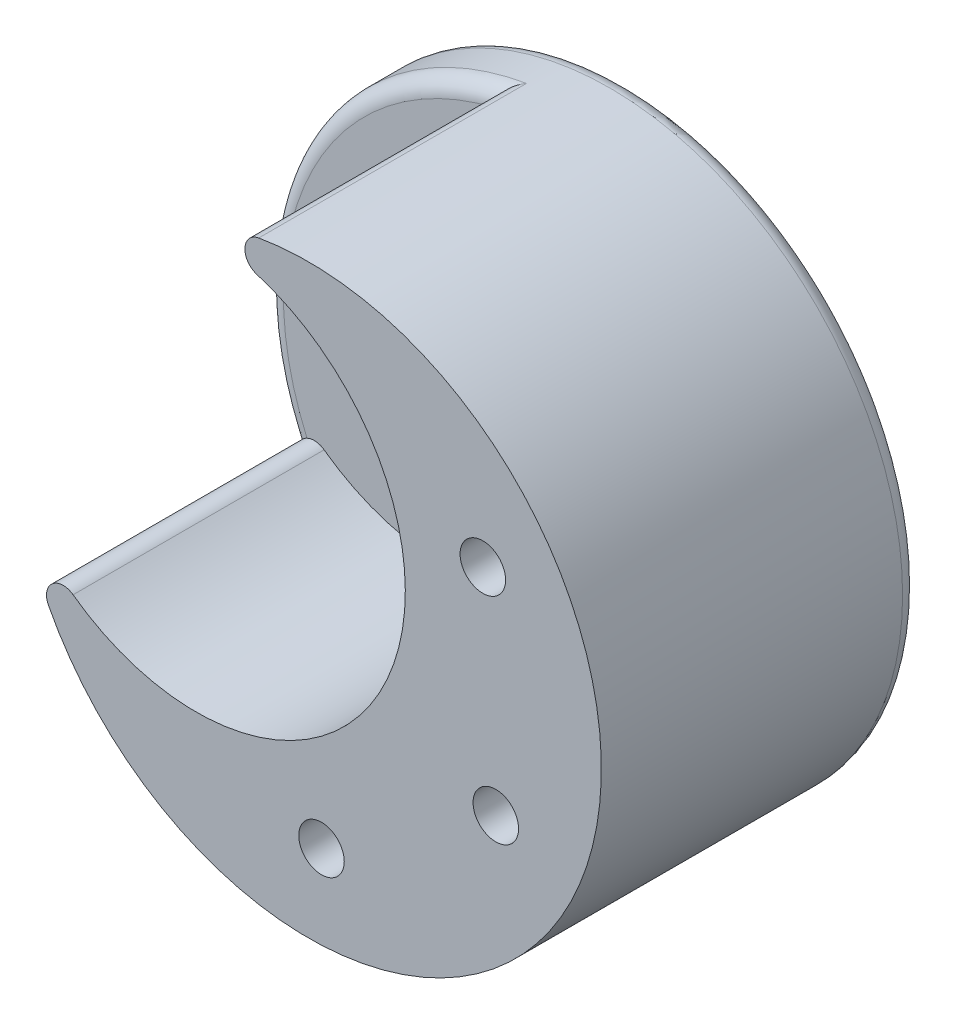
ISO-10303-21;
HEADER;
FILE_DESCRIPTION(('STEP AP214'),'2;1');
FILE_NAME('part.step','',(''),(''),'','','');
FILE_SCHEMA(('AUTOMOTIVE_DESIGN { 1 0 10303 214 1 1 1 1 }'));
ENDSEC;
DATA;
#1=APPLICATION_CONTEXT('core data for automotive mechanical design processes');
#2=APPLICATION_PROTOCOL_DEFINITION('international standard','automotive_design',2000,#1);
#3=PRODUCT_CONTEXT('',#1,'mechanical');
#4=PRODUCT('Part','Part','',(#3));
#5=PRODUCT_RELATED_PRODUCT_CATEGORY('part','',(#4));
#6=PRODUCT_DEFINITION_FORMATION('','',#4);
#7=PRODUCT_DEFINITION_CONTEXT('part definition',#1,'design');
#8=PRODUCT_DEFINITION('design','',#6,#7);
#9=PRODUCT_DEFINITION_SHAPE('','',#8);
#10=(LENGTH_UNIT() NAMED_UNIT(*) SI_UNIT(.MILLI.,.METRE.));
#11=(NAMED_UNIT(*) PLANE_ANGLE_UNIT() SI_UNIT($,.RADIAN.));
#12=(NAMED_UNIT(*) SI_UNIT($,.STERADIAN.) SOLID_ANGLE_UNIT());
#13=UNCERTAINTY_MEASURE_WITH_UNIT(LENGTH_MEASURE(1.E-05),#10,'distance_accuracy_value','');
#14=(GEOMETRIC_REPRESENTATION_CONTEXT(3) GLOBAL_UNCERTAINTY_ASSIGNED_CONTEXT((#13)) GLOBAL_UNIT_ASSIGNED_CONTEXT((#10,
#11,#12)) REPRESENTATION_CONTEXT('',''));
#15=CARTESIAN_POINT('',(0.,0.,0.));
#16=DIRECTION('',(0.,0.,1.));
#17=DIRECTION('',(1.,0.,0.));
#18=AXIS2_PLACEMENT_3D('',#15,#16,#17);
#19=CARTESIAN_POINT('',(8.52852043318062,-4.24145779429903,5.08));
#20=DIRECTION('',(0.,0.,1.));
#21=DIRECTION('',(1.,0.,0.));
#22=AXIS2_PLACEMENT_3D('',#19,#20,#21);
#23=PLANE('',#22);
#24=CARTESIAN_POINT('',(0.,0.,5.08));
#25=DIRECTION('',(0.,0.,1.));
#26=DIRECTION('',(1.,0.,0.));
#27=AXIS2_PLACEMENT_3D('',#24,#25,#26);
#28=CIRCLE('',#27,7.62);
#29=CARTESIAN_POINT('',(7.62,0.,5.08));
#30=VERTEX_POINT('',#29);
#31=EDGE_CURVE('E134',#30,#30,#28,.T.);
#32=ORIENTED_EDGE('',*,*,#31,.F.);
#33=EDGE_LOOP('',(#32));
#34=FACE_BOUND('',#33,.T.);
#35=CARTESIAN_POINT('',(0.,0.,5.08));
#36=DIRECTION('',(0.,0.,-1.));
#37=DIRECTION('',(1.,0.,0.));
#38=AXIS2_PLACEMENT_3D('',#35,#36,#37);
#39=CIRCLE('',#38,15.875);
#40=CARTESIAN_POINT('',(4.60118952070614,15.1935736413309,5.08));
#41=VERTEX_POINT('',#40);
#42=CARTESIAN_POINT('',(-9.33925642802879,-12.8372082000536,5.08));
#43=VERTEX_POINT('',#42);
#44=EDGE_CURVE('E124',#41,#43,#39,.T.);
#45=ORIENTED_EDGE('',*,*,#44,.F.);
#46=CARTESIAN_POINT('',(4.96928468236263,16.4090595326373,5.08));
#47=DIRECTION('',(0.,0.,1.));
#48=DIRECTION('',(1.,0.,0.));
#49=AXIS2_PLACEMENT_3D('',#46,#47,#48);
#50=CIRCLE('',#49,1.27);
#51=CARTESIAN_POINT('',(3.7248496455398,16.1555216870841,5.08));
#52=VERTEX_POINT('',#51);
#53=EDGE_CURVE('E11',#41,#52,#50,.F.);
#54=ORIENTED_EDGE('',*,*,#53,.T.);
#55=CARTESIAN_POINT('',(8.52852043318062,-4.24145779429903,5.08));
#56=DIRECTION('',(0.,0.,1.));
#57=DIRECTION('',(1.,0.,0.));
#58=AXIS2_PLACEMENT_3D('',#55,#56,#57);
#59=CIRCLE('',#58,20.955);
#60=CARTESIAN_POINT('',(-10.6351375176274,-12.7188535585908,5.08));
#61=VERTEX_POINT('',#60);
#62=EDGE_CURVE('E59',#52,#61,#59,.T.);
#63=ORIENTED_EDGE('',*,*,#62,.T.);
#64=CARTESIAN_POINT('',(-10.0863969422711,-13.8641848560579,5.08));
#65=DIRECTION('',(0.,0.,1.));
#66=DIRECTION('',(1.,0.,0.));
#67=AXIS2_PLACEMENT_3D('',#64,#65,#66);
#68=CIRCLE('',#67,1.27);
#69=EDGE_CURVE('E51',#61,#43,#68,.F.);
#70=ORIENTED_EDGE('',*,*,#69,.T.);
#71=EDGE_LOOP('',(#45,#54,#63,#70));
#72=FACE_BOUND('',#71,.T.);
#73=ADVANCED_FACE('F37',(#34,#72),#23,.T.);
#74=CARTESIAN_POINT('',(8.52852043318062,-4.24145779429903,0.));
#75=DIRECTION('',(0.,0.,1.));
#76=DIRECTION('',(1.,0.,0.));
#77=AXIS2_PLACEMENT_3D('',#74,#75,#76);
#78=PLANE('',#77);
#79=CARTESIAN_POINT('',(8.52852043318062,-4.24145779429903,0.));
#80=DIRECTION('',(0.,0.,1.));
#81=DIRECTION('',(1.,0.,0.));
#82=AXIS2_PLACEMENT_3D('',#79,#80,#81);
#83=CIRCLE('',#82,20.955);
#84=CARTESIAN_POINT('',(29.4835204331806,-4.24145779429903,0.));
#85=VERTEX_POINT('',#84);
#86=EDGE_CURVE('E149',#85,#85,#83,.F.);
#87=ORIENTED_EDGE('',*,*,#86,.T.);
#88=EDGE_LOOP('',(#87));
#89=FACE_BOUND('',#88,.T.);
#90=CARTESIAN_POINT('',(0.,0.,0.));
#91=DIRECTION('',(0.,0.,1.));
#92=DIRECTION('',(1.,0.,0.));
#93=AXIS2_PLACEMENT_3D('',#90,#91,#92);
#94=CIRCLE('',#93,7.62);
#95=CARTESIAN_POINT('',(7.62,0.,0.));
#96=VERTEX_POINT('',#95);
#97=EDGE_CURVE('E131',#96,#96,#94,.T.);
#98=ORIENTED_EDGE('',*,*,#97,.T.);
#99=EDGE_LOOP('',(#98));
#100=FACE_BOUND('',#99,.T.);
#101=ADVANCED_FACE('F185',(#89,#100),#78,.F.);
#102=CARTESIAN_POINT('',(8.52852043318062,-4.24145779429903,5.08));
#103=DIRECTION('',(0.,0.,-1.));
#104=DIRECTION('',(-1.,0.,0.));
#105=AXIS2_PLACEMENT_3D('',#102,#103,#104);
#106=CYLINDRICAL_SURFACE('',#105,22.225);
#107=CARTESIAN_POINT('',(8.52852043318062,-4.24145779429903,1.27));
#108=DIRECTION('',(0.,0.,1.));
#109=DIRECTION('',(1.,0.,0.));
#110=AXIS2_PLACEMENT_3D('',#107,#108,#109);
#111=CIRCLE('',#110,22.225);
#112=CARTESIAN_POINT('',(30.7535204331806,-4.24145779429903,1.27));
#113=VERTEX_POINT('',#112);
#114=EDGE_CURVE('E146',#113,#113,#111,.T.);
#115=ORIENTED_EDGE('',*,*,#114,.T.);
#116=EDGE_LOOP('',(#115));
#117=FACE_BOUND('',#116,.T.);
#118=CARTESIAN_POINT('',(8.52852043318062,-4.24145779429903,24.1300508000018));
#119=DIRECTION('',(0.,0.,1.));
#120=DIRECTION('',(0.,-1.,0.));
#121=AXIS2_PLACEMENT_3D('',#118,#119,#120);
#122=CIRCLE('',#121,22.225);
#123=CARTESIAN_POINT('',(-11.2145737529045,-14.4473804355584,24.1300508000018));
#124=VERTEX_POINT('',#123);
#125=CARTESIAN_POINT('',(4.7535734247373,17.6606060373001,24.1300508000018));
#126=VERTEX_POINT('',#125);
#127=EDGE_CURVE('E127',#124,#126,#122,.T.);
#128=ORIENTED_EDGE('',*,*,#127,.F.);
#129=DIRECTION('',(0.,0.,-1.));
#130=VECTOR('',#129,1.);
#131=CARTESIAN_POINT('',(-11.2145737529045,-14.4473804355584,5.08));
#132=LINE('',#131,#130);
#133=CARTESIAN_POINT('',(-11.2145737529045,-14.4473804355584,3.81));
#134=VERTEX_POINT('',#133);
#135=EDGE_CURVE('E144',#124,#134,#132,.T.);
#136=ORIENTED_EDGE('',*,*,#135,.T.);
#137=CARTESIAN_POINT('',(8.52852043318062,-4.24145779429903,3.81));
#138=DIRECTION('',(0.,0.,1.));
#139=DIRECTION('',(1.,0.,0.));
#140=AXIS2_PLACEMENT_3D('',#137,#138,#139);
#141=CIRCLE('',#140,22.225);
#142=CARTESIAN_POINT('',(4.7535734247373,17.6606060373001,3.81));
#143=VERTEX_POINT('',#142);
#144=EDGE_CURVE('E142',#134,#143,#141,.F.);
#145=ORIENTED_EDGE('',*,*,#144,.T.);
#146=DIRECTION('',(0.,0.,-1.));
#147=VECTOR('',#146,1.);
#148=CARTESIAN_POINT('',(4.7535734247373,17.6606060373001,5.08));
#149=LINE('',#148,#147);
#150=EDGE_CURVE('E140',#143,#126,#149,.F.);
#151=ORIENTED_EDGE('',*,*,#150,.T.);
#152=EDGE_LOOP('',(#128,#136,#145,#151));
#153=FACE_BOUND('',#152,.T.);
#154=ADVANCED_FACE('F191',(#117,#153),#106,.T.);
#155=CARTESIAN_POINT('',(0.,0.,5.08));
#156=DIRECTION('',(0.,0.,-1.));
#157=DIRECTION('',(-1.,0.,0.));
#158=AXIS2_PLACEMENT_3D('',#155,#156,#157);
#159=CYLINDRICAL_SURFACE('',#158,7.62);
#160=ORIENTED_EDGE('',*,*,#31,.T.);
#161=EDGE_LOOP('',(#160));
#162=FACE_BOUND('',#161,.T.);
#163=ORIENTED_EDGE('',*,*,#97,.F.);
#164=EDGE_LOOP('',(#163));
#165=FACE_BOUND('',#164,.T.);
#166=ADVANCED_FACE('F196',(#162,#165),#159,.F.);
#167=CARTESIAN_POINT('',(0.,0.,86.6622419272734));
#168=DIRECTION('',(0.,0.,-1.));
#169=DIRECTION('',(-1.,0.,0.));
#170=AXIS2_PLACEMENT_3D('',#167,#168,#169);
#171=CYLINDRICAL_SURFACE('',#170,15.875);
#172=ORIENTED_EDGE('',*,*,#44,.T.);
#173=DIRECTION('',(0.,0.,-1.));
#174=VECTOR('',#173,1.);
#175=CARTESIAN_POINT('',(-9.33925642802879,-12.8372082000536,86.6622419272734));
#176=LINE('',#175,#174);
#177=CARTESIAN_POINT('',(-9.33925642802879,-12.8372082000536,24.1300508000018));
#178=VERTEX_POINT('',#177);
#179=EDGE_CURVE('E154',#43,#178,#176,.F.);
#180=ORIENTED_EDGE('',*,*,#179,.T.);
#181=CARTESIAN_POINT('',(0.,0.,24.1300508000018));
#182=DIRECTION('',(0.,0.,1.));
#183=DIRECTION('',(0.,-1.,0.));
#184=AXIS2_PLACEMENT_3D('',#181,#182,#183);
#185=CIRCLE('',#184,15.875);
#186=CARTESIAN_POINT('',(4.60118952070614,15.1935736413309,24.1300508000018));
#187=VERTEX_POINT('',#186);
#188=EDGE_CURVE('E128',#187,#178,#185,.F.);
#189=ORIENTED_EDGE('',*,*,#188,.F.);
#190=DIRECTION('',(0.,0.,-1.));
#191=VECTOR('',#190,1.);
#192=CARTESIAN_POINT('',(4.60118952070614,15.1935736413309,86.6622419272734));
#193=LINE('',#192,#191);
#194=EDGE_CURVE('E152',#187,#41,#193,.T.);
#195=ORIENTED_EDGE('',*,*,#194,.T.);
#196=EDGE_LOOP('',(#172,#180,#189,#195));
#197=FACE_BOUND('',#196,.T.);
#198=ADVANCED_FACE('F180',(#197),#171,.F.);
#199=CARTESIAN_POINT('',(-79.5995240430194,39.5869394134577,24.1300508000018));
#200=DIRECTION('',(0.,0.,1.));
#201=DIRECTION('',(-0.890241670673383,-0.455488493594146,0.));
#202=AXIS2_PLACEMENT_3D('',#199,#200,#201);
#203=PLANE('',#202);
#204=CARTESIAN_POINT('',(21.7576377924019,4.5338529635003,24.1300508000018));
#205=DIRECTION('',(0.,0.,1.));
#206=DIRECTION('',(1.,0.,0.));
#207=AXIS2_PLACEMENT_3D('',#204,#205,#206);
#208=CIRCLE('',#207,1.7272);
#209=CARTESIAN_POINT('',(23.4848377924019,4.5338529635003,24.1300508000018));
#210=VERTEX_POINT('',#209);
#211=EDGE_CURVE('E107',#210,#210,#208,.T.);
#212=ORIENTED_EDGE('',*,*,#211,.F.);
#213=EDGE_LOOP('',(#212));
#214=FACE_BOUND('',#213,.T.);
#215=CARTESIAN_POINT('',(22.7427211551484,-11.3105541181308,24.1300508000018));
#216=DIRECTION('',(0.,0.,1.));
#217=DIRECTION('',(1.,0.,0.));
#218=AXIS2_PLACEMENT_3D('',#215,#216,#217);
#219=CIRCLE('',#218,1.7272);
#220=CARTESIAN_POINT('',(24.4699211551484,-11.3105541181308,24.1300508000018));
#221=VERTEX_POINT('',#220);
#222=EDGE_CURVE('E106',#221,#221,#219,.T.);
#223=ORIENTED_EDGE('',*,*,#222,.F.);
#224=EDGE_LOOP('',(#223));
#225=FACE_BOUND('',#224,.T.);
#226=CARTESIAN_POINT('',(9.51360379592698,-20.0858648759301,24.1300508000018));
#227=DIRECTION('',(0.,0.,1.));
#228=DIRECTION('',(1.,0.,0.));
#229=AXIS2_PLACEMENT_3D('',#226,#227,#228);
#230=CIRCLE('',#229,1.7272);
#231=CARTESIAN_POINT('',(11.240803795927,-20.0858648759301,24.1300508000018));
#232=VERTEX_POINT('',#231);
#233=EDGE_CURVE('E117',#232,#232,#230,.T.);
#234=ORIENTED_EDGE('',*,*,#233,.F.);
#235=EDGE_LOOP('',(#234));
#236=FACE_BOUND('',#235,.T.);
#237=ORIENTED_EDGE('',*,*,#188,.T.);
#238=CARTESIAN_POINT('',(-10.0863969422711,-13.8641848560579,24.1300508000018));
#239=DIRECTION('',(0.,0.,1.));
#240=DIRECTION('',(0.,-1.,0.));
#241=AXIS2_PLACEMENT_3D('',#238,#239,#240);
#242=CIRCLE('',#241,1.27);
#243=EDGE_CURVE('E158',#178,#124,#242,.T.);
#244=ORIENTED_EDGE('',*,*,#243,.T.);
#245=ORIENTED_EDGE('',*,*,#127,.T.);
#246=CARTESIAN_POINT('',(4.96928468236263,16.4090595326373,24.1300508000018));
#247=DIRECTION('',(0.,0.,1.));
#248=DIRECTION('',(0.,-1.,0.));
#249=AXIS2_PLACEMENT_3D('',#246,#247,#248);
#250=CIRCLE('',#249,1.27);
#251=EDGE_CURVE('E156',#126,#187,#250,.T.);
#252=ORIENTED_EDGE('',*,*,#251,.T.);
#253=EDGE_LOOP('',(#237,#244,#245,#252));
#254=FACE_BOUND('',#253,.T.);
#255=ADVANCED_FACE('F175',(#214,#225,#236,#254),#203,.T.);
#256=CARTESIAN_POINT('',(4.96928468236263,16.4090595326373,5.08));
#257=DIRECTION('',(0.,0.,1.));
#258=DIRECTION('',(1.,0.,0.));
#259=AXIS2_PLACEMENT_3D('',#256,#257,#258);
#260=CYLINDRICAL_SURFACE('',#259,1.27);
#261=ORIENTED_EDGE('',*,*,#251,.F.);
#262=ORIENTED_EDGE('',*,*,#150,.F.);
#263=CARTESIAN_POINT('',(3.7248496455398,16.1555216870841,5.08));
#264=CARTESIAN_POINT('',(3.71911923100109,16.1836285431695,5.08000385529572));
#265=CARTESIAN_POINT('',(3.71435328293819,16.2119130200748,5.07902824486928));
#266=CARTESIAN_POINT('',(3.70675420831323,16.268588334487,5.07517525051832));
#267=CARTESIAN_POINT('',(3.70391946631716,16.2969790630749,5.07229946005183));
#268=CARTESIAN_POINT('',(3.69834119822427,16.3814746362123,5.060976531482));
#269=CARTESIAN_POINT('',(3.69841598621895,16.4374410059657,5.04983145985835));
#270=CARTESIAN_POINT('',(3.70560561560602,16.547013865641,5.02127475231199));
#271=CARTESIAN_POINT('',(3.71269947042803,16.6006268928852,5.00388189561275));
#272=CARTESIAN_POINT('',(3.73304101694456,16.7047336041614,4.96388203787537));
#273=CARTESIAN_POINT('',(3.74630303641471,16.7552197137341,4.94126295895132));
#274=CARTESIAN_POINT('',(3.7845175763971,16.8720821363565,4.88182432610968));
#275=CARTESIAN_POINT('',(3.8120305323327,16.9365838406939,4.84296849912566));
#276=CARTESIAN_POINT('',(3.87506986846454,17.0573275370206,4.75941234328102));
#277=CARTESIAN_POINT('',(3.91061042836846,17.1135546191537,4.71470173216637));
#278=CARTESIAN_POINT('',(4.00179107059138,17.2364880995299,4.60431160556647));
#279=CARTESIAN_POINT('',(4.06005866453161,17.2996676934575,4.53688239495431));
#280=CARTESIAN_POINT('',(4.1846405306755,17.411175302359,4.39740116552969));
#281=CARTESIAN_POINT('',(4.25096505581083,17.4594841113091,4.32534331258663));
#282=CARTESIAN_POINT('',(4.3872943573545,17.5405605710733,4.18070203610349));
#283=CARTESIAN_POINT('',(4.45714045937131,17.5737317605861,4.10819206762204));
#284=CARTESIAN_POINT('',(4.60043290500568,17.6267067835818,3.96213330252387));
#285=CARTESIAN_POINT('',(4.67387108246471,17.6465395518141,3.8885871101857));
#286=CARTESIAN_POINT('',(4.75011436911654,17.6600061531204,3.81340890493721));
#287=CARTESIAN_POINT('',(4.75184361221322,17.6603078907709,3.81170442878292));
#288=CARTESIAN_POINT('',(4.7535734247373,17.6606060373001,3.81));
#289=B_SPLINE_CURVE_WITH_KNOTS('',3,(#263,#264,#265,#266,#267,#268,#269,#270,#271,#272,#273,
#274,#275,#276,#277,#278,#279,#280,#281,#282,#283,#284,#285,#286,#287,#288),.UNSPECIFIED.,.F.,
.F.,(4,2,2,2,2,2,2,2,2,2,2,2,4),(0.,0.0859874204768841,0.171902824753545,0.342113187932405,
0.511816165947236,0.681915323998199,0.921102531307441,1.16071558203132,1.48668770874832,
1.81307908788524,2.13017202576222,2.44657486275175,2.4539150880264),.UNSPECIFIED.);
#290=EDGE_CURVE('E41',#52,#143,#289,.T.);
#291=ORIENTED_EDGE('',*,*,#290,.F.);
#292=ORIENTED_EDGE('',*,*,#53,.F.);
#293=ORIENTED_EDGE('',*,*,#194,.F.);
#294=EDGE_LOOP('',(#261,#262,#291,#292,#293));
#295=FACE_BOUND('',#294,.T.);
#296=ADVANCED_FACE('F171',(#295),#260,.T.);
#297=CARTESIAN_POINT('',(-10.0863969422711,-13.8641848560579,86.6622419272734));
#298=DIRECTION('',(0.,0.,1.));
#299=DIRECTION('',(1.,0.,0.));
#300=AXIS2_PLACEMENT_3D('',#297,#298,#299);
#301=CYLINDRICAL_SURFACE('',#300,1.27);
#302=ORIENTED_EDGE('',*,*,#179,.F.);
#303=ORIENTED_EDGE('',*,*,#69,.F.);
#304=CARTESIAN_POINT('',(-10.6351375176274,-12.7188535585908,5.08));
#305=CARTESIAN_POINT('',(-10.6610084262347,-12.731244244513,5.08000385529572));
#306=CARTESIAN_POINT('',(-10.6864389950207,-12.7445111984197,5.07902824486928));
#307=CARTESIAN_POINT('',(-10.7362186430045,-12.7726505631155,5.07517525051832));
#308=CARTESIAN_POINT('',(-10.7605686101336,-12.7875216199963,5.07229946005183));
#309=CARTESIAN_POINT('',(-10.8313133821091,-12.8340597354809,5.060976531482));
#310=CARTESIAN_POINT('',(-10.8758971356103,-12.8678906246264,5.04983145985835));
#311=CARTESIAN_POINT('',(-10.9589347075479,-12.9397423051554,5.02127475231199));
#312=CARTESIAN_POINT('',(-10.9974064027225,-12.9777503061146,5.00388189561275));
#313=CARTESIAN_POINT('',(-11.0681490054474,-13.0567912449195,4.96388203787537));
#314=CARTESIAN_POINT('',(-11.1004052272753,-13.0978310374823,4.94126295895132));
#315=CARTESIAN_POINT('',(-11.1705346006798,-13.1988213730255,4.88182432610968));
#316=CARTESIAN_POINT('',(-11.2053678766936,-13.2596824894209,4.84296849912566));
#317=CARTESIAN_POINT('',(-11.2636124784104,-13.3828107334326,4.75941234328103));
#318=CARTESIAN_POINT('',(-11.2870033583227,-13.445080171365,4.71470173216639));
#319=CARTESIAN_POINT('',(-11.3300131053569,-13.5919703064104,4.60431160556645));
#320=CARTESIAN_POINT('',(-11.3452341226491,-13.6765580964573,4.53688239495423));
#321=CARTESIAN_POINT('',(-11.3589776333629,-13.8431885382383,4.39740116552977));
#322=CARTESIAN_POINT('',(-11.3574786246266,-13.9252277765907,4.32534331258694));
#323=CARTESIAN_POINT('',(-11.3398669881361,-14.08286311859,4.18070203610319));
#324=CARTESIAN_POINT('',(-11.3241718988766,-14.1585761950937,4.10819206762093));
#325=CARTESIAN_POINT('',(-11.2799498210579,-14.3048071284536,3.96213330252496));
#326=CARTESIAN_POINT('',(-11.2514508333665,-14.3753359332447,3.88858711018978));
#327=CARTESIAN_POINT('',(-11.2161826562021,-14.4442601219533,3.81340890493739));
#328=CARTESIAN_POINT('',(-11.2153798081772,-14.4458211351966,3.81170442878301));
#329=CARTESIAN_POINT('',(-11.2145737529045,-14.4473804355584,3.81));
#330=B_SPLINE_CURVE_WITH_KNOTS('',3,(#304,#305,#306,#307,#308,#309,#310,#311,#312,#313,#314,
#315,#316,#317,#318,#319,#320,#321,#322,#323,#324,#325,#326,#327,#328,#329),.UNSPECIFIED.,.F.,
.F.,(4,2,2,2,2,2,2,2,2,2,2,2,4),(0.,0.085987420476881,0.171902824753539,0.342113187932405,
0.511816165947234,0.681915323998195,0.921102531307435,1.16071558203131,1.48668770874833,
1.81307908788524,2.13017202576222,2.44657486275175,2.45391508802641),.UNSPECIFIED.);
#331=EDGE_CURVE('E123',#134,#61,#330,.F.);
#332=ORIENTED_EDGE('',*,*,#331,.F.);
#333=ORIENTED_EDGE('',*,*,#135,.F.);
#334=ORIENTED_EDGE('',*,*,#243,.F.);
#335=EDGE_LOOP('',(#302,#303,#332,#333,#334));
#336=FACE_BOUND('',#335,.T.);
#337=ADVANCED_FACE('F168',(#336),#301,.T.);
#338=CARTESIAN_POINT('',(8.52852043318062,-4.24145779429903,3.81));
#339=DIRECTION('',(0.,0.,1.));
#340=DIRECTION('',(1.,0.,0.));
#341=AXIS2_PLACEMENT_3D('',#338,#339,#340);
#342=TOROIDAL_SURFACE('',#341,20.955,1.27);
#343=ORIENTED_EDGE('',*,*,#290,.T.);
#344=ORIENTED_EDGE('',*,*,#144,.F.);
#345=ORIENTED_EDGE('',*,*,#331,.T.);
#346=ORIENTED_EDGE('',*,*,#62,.F.);
#347=EDGE_LOOP('',(#343,#344,#345,#346));
#348=FACE_BOUND('',#347,.T.);
#349=ADVANCED_FACE('F165',(#348),#342,.T.);
#350=CARTESIAN_POINT('',(8.52852043318062,-4.24145779429903,1.27));
#351=DIRECTION('',(0.,0.,1.));
#352=DIRECTION('',(1.,0.,0.));
#353=AXIS2_PLACEMENT_3D('',#350,#351,#352);
#354=TOROIDAL_SURFACE('',#353,20.955,1.27);
#355=ORIENTED_EDGE('',*,*,#86,.F.);
#356=EDGE_LOOP('',(#355));
#357=FACE_BOUND('',#356,.T.);
#358=ORIENTED_EDGE('',*,*,#114,.F.);
#359=EDGE_LOOP('',(#358));
#360=FACE_BOUND('',#359,.T.);
#361=ADVANCED_FACE('F39',(#357,#360),#354,.T.);
#362=CARTESIAN_POINT('',(9.51360379592698,-20.0858648759301,11.4300508000018));
#363=DIRECTION('',(0.,0.,1.));
#364=DIRECTION('',(1.,0.,0.));
#365=AXIS2_PLACEMENT_3D('',#362,#363,#364);
#366=CONICAL_SURFACE('',#365,1.7272,1.02974425867665);
#367=CARTESIAN_POINT('',(9.51360379592697,-20.0858648759301,10.3922443388174));
#368=VERTEX_POINT('',#367);
#369=VERTEX_LOOP('',#368);
#370=FACE_BOUND('',#369,.T.);
#371=CARTESIAN_POINT('',(9.51360379592698,-20.0858648759301,11.4300508000018));
#372=DIRECTION('',(0.,0.,1.));
#373=DIRECTION('',(1.,0.,0.));
#374=AXIS2_PLACEMENT_3D('',#371,#372,#373);
#375=CIRCLE('',#374,1.7272);
#376=CARTESIAN_POINT('',(11.240803795927,-20.0858648759301,11.4300508000018));
#377=VERTEX_POINT('',#376);
#378=EDGE_CURVE('E120',#377,#377,#375,.T.);
#379=ORIENTED_EDGE('',*,*,#378,.T.);
#380=EDGE_LOOP('',(#379));
#381=FACE_BOUND('',#380,.T.);
#382=ADVANCED_FACE('F224',(#370,#381),#366,.F.);
#383=CARTESIAN_POINT('',(9.51360379592698,-20.0858648759301,24.1300508000018));
#384=DIRECTION('',(0.,0.,1.));
#385=DIRECTION('',(1.,0.,0.));
#386=AXIS2_PLACEMENT_3D('',#383,#384,#385);
#387=CYLINDRICAL_SURFACE('',#386,1.7272);
#388=ORIENTED_EDGE('',*,*,#378,.F.);
#389=EDGE_LOOP('',(#388));
#390=FACE_BOUND('',#389,.T.);
#391=ORIENTED_EDGE('',*,*,#233,.T.);
#392=EDGE_LOOP('',(#391));
#393=FACE_BOUND('',#392,.T.);
#394=ADVANCED_FACE('F227',(#390,#393),#387,.F.);
#395=CARTESIAN_POINT('',(22.7427211551484,-11.3105541181308,11.4300508000018));
#396=DIRECTION('',(0.,0.,1.));
#397=DIRECTION('',(1.,0.,0.));
#398=AXIS2_PLACEMENT_3D('',#395,#396,#397);
#399=CONICAL_SURFACE('',#398,1.7272,1.02974425867665);
#400=CARTESIAN_POINT('',(22.7427211551484,-11.3105541181308,10.3922443388174));
#401=VERTEX_POINT('',#400);
#402=VERTEX_LOOP('',#401);
#403=FACE_BOUND('',#402,.T.);
#404=CARTESIAN_POINT('',(22.7427211551484,-11.3105541181308,11.4300508000018));
#405=DIRECTION('',(0.,0.,1.));
#406=DIRECTION('',(1.,0.,0.));
#407=AXIS2_PLACEMENT_3D('',#404,#405,#406);
#408=CIRCLE('',#407,1.7272);
#409=CARTESIAN_POINT('',(24.4699211551484,-11.3105541181308,11.4300508000018));
#410=VERTEX_POINT('',#409);
#411=EDGE_CURVE('E110',#410,#410,#408,.T.);
#412=ORIENTED_EDGE('',*,*,#411,.T.);
#413=EDGE_LOOP('',(#412));
#414=FACE_BOUND('',#413,.T.);
#415=ADVANCED_FACE('F231',(#403,#414),#399,.F.);
#416=CARTESIAN_POINT('',(22.7427211551484,-11.3105541181308,24.1300508000018));
#417=DIRECTION('',(0.,0.,1.));
#418=DIRECTION('',(1.,0.,0.));
#419=AXIS2_PLACEMENT_3D('',#416,#417,#418);
#420=CYLINDRICAL_SURFACE('',#419,1.7272);
#421=ORIENTED_EDGE('',*,*,#411,.F.);
#422=EDGE_LOOP('',(#421));
#423=FACE_BOUND('',#422,.T.);
#424=ORIENTED_EDGE('',*,*,#222,.T.);
#425=EDGE_LOOP('',(#424));
#426=FACE_BOUND('',#425,.T.);
#427=ADVANCED_FACE('F100',(#423,#426),#420,.F.);
#428=CARTESIAN_POINT('',(21.7576377924019,4.5338529635003,11.4300508000018));
#429=DIRECTION('',(0.,0.,1.));
#430=DIRECTION('',(1.,0.,0.));
#431=AXIS2_PLACEMENT_3D('',#428,#429,#430);
#432=CONICAL_SURFACE('',#431,1.7272,1.02974425867665);
#433=CARTESIAN_POINT('',(21.7576377924019,4.5338529635003,10.3922443388174));
#434=VERTEX_POINT('',#433);
#435=VERTEX_LOOP('',#434);
#436=FACE_BOUND('',#435,.T.);
#437=CARTESIAN_POINT('',(21.7576377924019,4.5338529635003,11.4300508000018));
#438=DIRECTION('',(0.,0.,1.));
#439=DIRECTION('',(1.,0.,0.));
#440=AXIS2_PLACEMENT_3D('',#437,#438,#439);
#441=CIRCLE('',#440,1.7272);
#442=CARTESIAN_POINT('',(23.4848377924019,4.5338529635003,11.4300508000018));
#443=VERTEX_POINT('',#442);
#444=EDGE_CURVE('E104',#443,#443,#441,.T.);
#445=ORIENTED_EDGE('',*,*,#444,.T.);
#446=EDGE_LOOP('',(#445));
#447=FACE_BOUND('',#446,.T.);
#448=ADVANCED_FACE('F96',(#436,#447),#432,.F.);
#449=CARTESIAN_POINT('',(21.7576377924019,4.5338529635003,24.1300508000018));
#450=DIRECTION('',(0.,0.,1.));
#451=DIRECTION('',(1.,0.,0.));
#452=AXIS2_PLACEMENT_3D('',#449,#450,#451);
#453=CYLINDRICAL_SURFACE('',#452,1.7272);
#454=ORIENTED_EDGE('',*,*,#444,.F.);
#455=EDGE_LOOP('',(#454));
#456=FACE_BOUND('',#455,.T.);
#457=ORIENTED_EDGE('',*,*,#211,.T.);
#458=EDGE_LOOP('',(#457));
#459=FACE_BOUND('',#458,.T.);
#460=ADVANCED_FACE('F99',(#456,#459),#453,.F.);
#461=CLOSED_SHELL('',(#73,#101,#154,#166,#198,#255,#296,#337,#349,#361,#382,#394,#415,#427,#448,#460));
#462=MANIFOLD_SOLID_BREP('B2',#461);
#463=ADVANCED_BREP_SHAPE_REPRESENTATION('',(#18,#462),#14);
#464=SHAPE_DEFINITION_REPRESENTATION(#9,#463);
ENDSEC;
END-ISO-10303-21;
